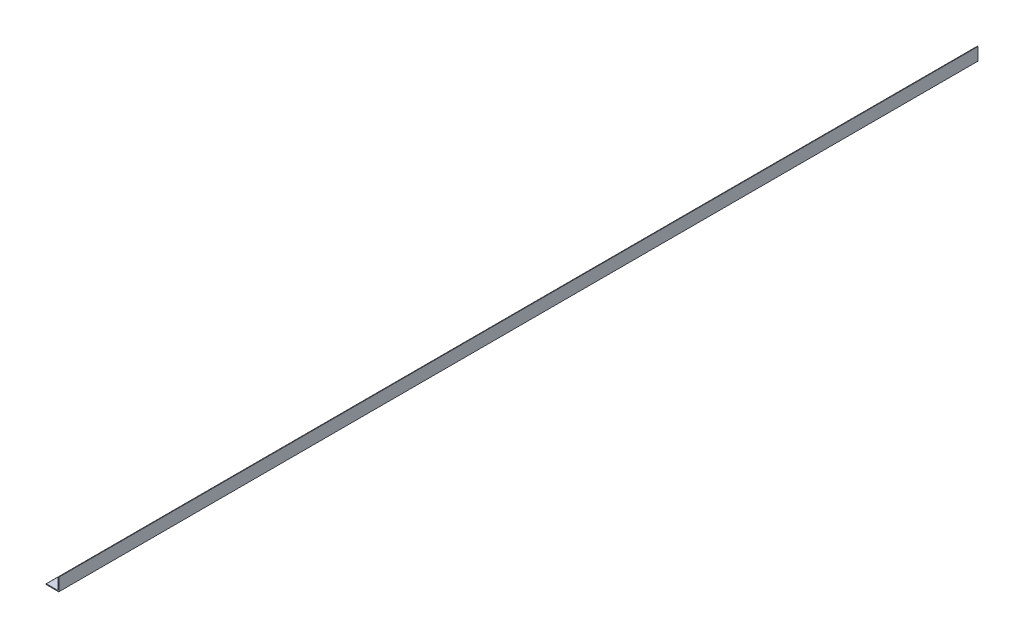
ISO-10303-21;
HEADER;
FILE_DESCRIPTION(('STEP AP214'),'2;1');
FILE_NAME('part.step','',(''),(''),'','','');
FILE_SCHEMA(('AUTOMOTIVE_DESIGN { 1 0 10303 214 1 1 1 1 }'));
ENDSEC;
DATA;
#1=APPLICATION_CONTEXT('core data for automotive mechanical design processes');
#2=APPLICATION_PROTOCOL_DEFINITION('international standard','automotive_design',2000,#1);
#3=PRODUCT_CONTEXT('',#1,'mechanical');
#4=PRODUCT('Part','Part','',(#3));
#5=PRODUCT_RELATED_PRODUCT_CATEGORY('part','',(#4));
#6=PRODUCT_DEFINITION_FORMATION('','',#4);
#7=PRODUCT_DEFINITION_CONTEXT('part definition',#1,'design');
#8=PRODUCT_DEFINITION('design','',#6,#7);
#9=PRODUCT_DEFINITION_SHAPE('','',#8);
#10=(LENGTH_UNIT() NAMED_UNIT(*) SI_UNIT(.MILLI.,.METRE.));
#11=(NAMED_UNIT(*) PLANE_ANGLE_UNIT() SI_UNIT($,.RADIAN.));
#12=(NAMED_UNIT(*) SI_UNIT($,.STERADIAN.) SOLID_ANGLE_UNIT());
#13=UNCERTAINTY_MEASURE_WITH_UNIT(LENGTH_MEASURE(1.E-05),#10,'distance_accuracy_value','');
#14=(GEOMETRIC_REPRESENTATION_CONTEXT(3) GLOBAL_UNCERTAINTY_ASSIGNED_CONTEXT((#13)) GLOBAL_UNIT_ASSIGNED_CONTEXT((#10,
#11,#12)) REPRESENTATION_CONTEXT('',''));
#15=CARTESIAN_POINT('',(0.,0.,0.));
#16=DIRECTION('',(0.,0.,1.));
#17=DIRECTION('',(1.,0.,0.));
#18=AXIS2_PLACEMENT_3D('',#15,#16,#17);
#19=CARTESIAN_POINT('',(-12.7,-11.90625,914.4));
#20=DIRECTION('',(1.,0.,0.));
#21=DIRECTION('',(0.,0.,-1.));
#22=AXIS2_PLACEMENT_3D('',#19,#20,#21);
#23=PLANE('',#22);
#24=DIRECTION('',(0.,-1.,0.));
#25=VECTOR('',#24,1.);
#26=CARTESIAN_POINT('',(-12.7,-11.90625,-914.4));
#27=LINE('',#26,#25);
#28=CARTESIAN_POINT('',(-12.7,-11.90625,-914.4));
#29=VERTEX_POINT('',#28);
#30=CARTESIAN_POINT('',(-12.7,-12.7,-914.4));
#31=VERTEX_POINT('',#30);
#32=EDGE_CURVE('E360',#29,#31,#27,.T.);
#33=ORIENTED_EDGE('',*,*,#32,.T.);
#34=DIRECTION('',(0.,0.,-1.));
#35=VECTOR('',#34,1.);
#36=CARTESIAN_POINT('',(-12.7,-12.7,914.4));
#37=LINE('',#36,#35);
#38=CARTESIAN_POINT('',(-12.7,-12.7,914.4));
#39=VERTEX_POINT('',#38);
#40=EDGE_CURVE('E11',#39,#31,#37,.T.);
#41=ORIENTED_EDGE('',*,*,#40,.F.);
#42=DIRECTION('',(0.,-1.,0.));
#43=VECTOR('',#42,1.);
#44=CARTESIAN_POINT('',(-12.7,-11.90625,914.4));
#45=LINE('',#44,#43);
#46=CARTESIAN_POINT('',(-12.7,-11.90625,914.4));
#47=VERTEX_POINT('',#46);
#48=EDGE_CURVE('E361',#47,#39,#45,.T.);
#49=ORIENTED_EDGE('',*,*,#48,.F.);
#50=DIRECTION('',(0.,0.,-1.));
#51=VECTOR('',#50,1.);
#52=CARTESIAN_POINT('',(-12.7,-11.90625,914.4));
#53=LINE('',#52,#51);
#54=EDGE_CURVE('E381',#47,#29,#53,.T.);
#55=ORIENTED_EDGE('',*,*,#54,.T.);
#56=EDGE_LOOP('',(#33,#41,#49,#55));
#57=FACE_BOUND('',#56,.T.);
#58=ADVANCED_FACE('F36',(#57),#23,.F.);
#59=CARTESIAN_POINT('',(-12.7,-12.7,914.4));
#60=DIRECTION('',(0.,1.,0.));
#61=DIRECTION('',(-1.,0.,0.));
#62=AXIS2_PLACEMENT_3D('',#59,#60,#61);
#63=PLANE('',#62);
#64=DIRECTION('',(0.,0.,1.));
#65=VECTOR('',#64,1.);
#66=CARTESIAN_POINT('',(-4.6355,-12.7,-701.675));
#67=LINE('',#66,#65);
#68=CARTESIAN_POINT('',(-4.6355,-12.7,-720.725));
#69=VERTEX_POINT('',#68);
#70=CARTESIAN_POINT('',(-4.6355,-12.7,-701.675));
#71=VERTEX_POINT('',#70);
#72=EDGE_CURVE('E214',#69,#71,#67,.T.);
#73=ORIENTED_EDGE('',*,*,#72,.T.);
#74=CARTESIAN_POINT('',(-1.5875,-12.7,-701.675));
#75=DIRECTION('',(0.,1.,0.));
#76=DIRECTION('',(0.,0.,1.));
#77=AXIS2_PLACEMENT_3D('',#74,#75,#76);
#78=CIRCLE('',#77,3.048);
#79=CARTESIAN_POINT('',(1.46050000000001,-12.7,-701.675));
#80=VERTEX_POINT('',#79);
#81=EDGE_CURVE('E206',#71,#80,#78,.T.);
#82=ORIENTED_EDGE('',*,*,#81,.T.);
#83=DIRECTION('',(0.,0.,-1.));
#84=VECTOR('',#83,1.);
#85=CARTESIAN_POINT('',(1.46050000000001,-12.7,-701.675));
#86=LINE('',#85,#84);
#87=CARTESIAN_POINT('',(1.4605,-12.7,-720.725));
#88=VERTEX_POINT('',#87);
#89=EDGE_CURVE('E217',#80,#88,#86,.T.);
#90=ORIENTED_EDGE('',*,*,#89,.T.);
#91=CARTESIAN_POINT('',(-1.5875,-12.7,-720.725));
#92=DIRECTION('',(0.,1.,0.));
#93=DIRECTION('',(0.,0.,1.));
#94=AXIS2_PLACEMENT_3D('',#91,#92,#93);
#95=CIRCLE('',#94,3.048);
#96=EDGE_CURVE('E50',#88,#69,#95,.T.);
#97=ORIENTED_EDGE('',*,*,#96,.T.);
#98=EDGE_LOOP('',(#73,#82,#90,#97));
#99=FACE_BOUND('',#98,.T.);
#100=DIRECTION('',(0.,0.,-1.));
#101=VECTOR('',#100,1.);
#102=CARTESIAN_POINT('',(1.4605,-12.7,-304.8));
#103=LINE('',#102,#101);
#104=CARTESIAN_POINT('',(1.4605,-12.7,-285.75));
#105=VERTEX_POINT('',#104);
#106=CARTESIAN_POINT('',(1.4605,-12.7,-304.8));
#107=VERTEX_POINT('',#106);
#108=EDGE_CURVE('E252',#105,#107,#103,.T.);
#109=ORIENTED_EDGE('',*,*,#108,.T.);
#110=CARTESIAN_POINT('',(-1.5875,-12.7,-304.8));
#111=DIRECTION('',(0.,1.,0.));
#112=DIRECTION('',(0.,0.,1.));
#113=AXIS2_PLACEMENT_3D('',#110,#111,#112);
#114=CIRCLE('',#113,3.048);
#115=CARTESIAN_POINT('',(-4.6355,-12.7,-304.8));
#116=VERTEX_POINT('',#115);
#117=EDGE_CURVE('E244',#107,#116,#114,.T.);
#118=ORIENTED_EDGE('',*,*,#117,.T.);
#119=DIRECTION('',(0.,0.,1.));
#120=VECTOR('',#119,1.);
#121=CARTESIAN_POINT('',(-4.6355,-12.7,-304.8));
#122=LINE('',#121,#120);
#123=CARTESIAN_POINT('',(-4.6355,-12.7,-285.75));
#124=VERTEX_POINT('',#123);
#125=EDGE_CURVE('E247',#116,#124,#122,.T.);
#126=ORIENTED_EDGE('',*,*,#125,.T.);
#127=CARTESIAN_POINT('',(-1.5875,-12.7,-285.75));
#128=DIRECTION('',(0.,1.,0.));
#129=DIRECTION('',(0.,0.,1.));
#130=AXIS2_PLACEMENT_3D('',#127,#128,#129);
#131=CIRCLE('',#130,3.048);
#132=EDGE_CURVE('E58',#124,#105,#131,.T.);
#133=ORIENTED_EDGE('',*,*,#132,.T.);
#134=EDGE_LOOP('',(#109,#118,#126,#133));
#135=FACE_BOUND('',#134,.T.);
#136=DIRECTION('',(0.,0.,1.));
#137=VECTOR('',#136,1.);
#138=CARTESIAN_POINT('',(-4.6355,-12.7,336.55));
#139=LINE('',#138,#137);
#140=CARTESIAN_POINT('',(-4.6355,-12.7,317.5));
#141=VERTEX_POINT('',#140);
#142=CARTESIAN_POINT('',(-4.6355,-12.7,336.55));
#143=VERTEX_POINT('',#142);
#144=EDGE_CURVE('E284',#141,#143,#139,.T.);
#145=ORIENTED_EDGE('',*,*,#144,.T.);
#146=CARTESIAN_POINT('',(-1.5875,-12.7,336.55));
#147=DIRECTION('',(0.,1.,0.));
#148=DIRECTION('',(0.,0.,-1.));
#149=AXIS2_PLACEMENT_3D('',#146,#147,#148);
#150=CIRCLE('',#149,3.048);
#151=CARTESIAN_POINT('',(1.4605,-12.7,336.55));
#152=VERTEX_POINT('',#151);
#153=EDGE_CURVE('E274',#143,#152,#150,.T.);
#154=ORIENTED_EDGE('',*,*,#153,.T.);
#155=DIRECTION('',(0.,0.,-1.));
#156=VECTOR('',#155,1.);
#157=CARTESIAN_POINT('',(1.4605,-12.7,336.55));
#158=LINE('',#157,#156);
#159=CARTESIAN_POINT('',(1.4605,-12.7,317.5));
#160=VERTEX_POINT('',#159);
#161=EDGE_CURVE('E277',#152,#160,#158,.T.);
#162=ORIENTED_EDGE('',*,*,#161,.T.);
#163=CARTESIAN_POINT('',(-1.5875,-12.7,317.5));
#164=DIRECTION('',(0.,1.,0.));
#165=DIRECTION('',(0.,0.,-1.));
#166=AXIS2_PLACEMENT_3D('',#163,#164,#165);
#167=CIRCLE('',#166,3.048);
#168=EDGE_CURVE('E281',#160,#141,#167,.T.);
#169=ORIENTED_EDGE('',*,*,#168,.T.);
#170=EDGE_LOOP('',(#145,#154,#162,#169));
#171=FACE_BOUND('',#170,.T.);
#172=DIRECTION('',(0.,0.,-1.));
#173=VECTOR('',#172,1.);
#174=CARTESIAN_POINT('',(1.4605,-12.7,717.55));
#175=LINE('',#174,#173);
#176=CARTESIAN_POINT('',(1.4605,-12.7,736.6));
#177=VERTEX_POINT('',#176);
#178=CARTESIAN_POINT('',(1.4605,-12.7,717.55));
#179=VERTEX_POINT('',#178);
#180=EDGE_CURVE('E316',#177,#179,#175,.T.);
#181=ORIENTED_EDGE('',*,*,#180,.T.);
#182=CARTESIAN_POINT('',(-1.5875,-12.7,717.55));
#183=DIRECTION('',(0.,1.,0.));
#184=DIRECTION('',(0.,0.,-1.));
#185=AXIS2_PLACEMENT_3D('',#182,#183,#184);
#186=CIRCLE('',#185,3.048);
#187=CARTESIAN_POINT('',(-4.6355,-12.7,717.55));
#188=VERTEX_POINT('',#187);
#189=EDGE_CURVE('E306',#179,#188,#186,.T.);
#190=ORIENTED_EDGE('',*,*,#189,.T.);
#191=DIRECTION('',(0.,0.,1.));
#192=VECTOR('',#191,1.);
#193=CARTESIAN_POINT('',(-4.6355,-12.7,717.55));
#194=LINE('',#193,#192);
#195=CARTESIAN_POINT('',(-4.6355,-12.7,736.6));
#196=VERTEX_POINT('',#195);
#197=EDGE_CURVE('E309',#188,#196,#194,.T.);
#198=ORIENTED_EDGE('',*,*,#197,.T.);
#199=CARTESIAN_POINT('',(-1.5875,-12.7,736.6));
#200=DIRECTION('',(0.,1.,0.));
#201=DIRECTION('',(0.,0.,-1.));
#202=AXIS2_PLACEMENT_3D('',#199,#200,#201);
#203=CIRCLE('',#202,3.048);
#204=EDGE_CURVE('E313',#196,#177,#203,.T.);
#205=ORIENTED_EDGE('',*,*,#204,.T.);
#206=EDGE_LOOP('',(#181,#190,#198,#205));
#207=FACE_BOUND('',#206,.T.);
#208=CARTESIAN_POINT('',(-1.5875,-12.7,705.104));
#209=DIRECTION('',(0.,1.,0.));
#210=DIRECTION('',(0.,0.,1.));
#211=AXIS2_PLACEMENT_3D('',#208,#209,#210);
#212=CIRCLE('',#211,2.5527);
#213=CARTESIAN_POINT('',(-1.5875,-12.7,707.6567));
#214=VERTEX_POINT('',#213);
#215=EDGE_CURVE('E339',#214,#214,#212,.T.);
#216=ORIENTED_EDGE('',*,*,#215,.T.);
#217=EDGE_LOOP('',(#216));
#218=FACE_BOUND('',#217,.T.);
#219=CARTESIAN_POINT('',(-1.5875,-12.7,249.428));
#220=DIRECTION('',(0.,1.,0.));
#221=DIRECTION('',(0.,0.,1.));
#222=AXIS2_PLACEMENT_3D('',#219,#220,#221);
#223=CIRCLE('',#222,2.5527);
#224=CARTESIAN_POINT('',(-1.5875,-12.7,251.9807));
#225=VERTEX_POINT('',#224);
#226=EDGE_CURVE('E345',#225,#225,#223,.T.);
#227=ORIENTED_EDGE('',*,*,#226,.T.);
#228=EDGE_LOOP('',(#227));
#229=FACE_BOUND('',#228,.T.);
#230=CARTESIAN_POINT('',(-1.5875,-12.7,-661.924));
#231=DIRECTION('',(0.,1.,0.));
#232=DIRECTION('',(0.,0.,1.));
#233=AXIS2_PLACEMENT_3D('',#230,#231,#232);
#234=CIRCLE('',#233,2.5527);
#235=CARTESIAN_POINT('',(-1.5875,-12.7,-659.3713));
#236=VERTEX_POINT('',#235);
#237=EDGE_CURVE('E351',#236,#236,#234,.T.);
#238=ORIENTED_EDGE('',*,*,#237,.T.);
#239=EDGE_LOOP('',(#238));
#240=FACE_BOUND('',#239,.T.);
#241=CARTESIAN_POINT('',(-1.5875,-12.7,-206.248));
#242=DIRECTION('',(0.,1.,0.));
#243=DIRECTION('',(0.,0.,1.));
#244=AXIS2_PLACEMENT_3D('',#241,#242,#243);
#245=CIRCLE('',#244,2.5527);
#246=CARTESIAN_POINT('',(-1.5875,-12.7,-203.6953));
#247=VERTEX_POINT('',#246);
#248=EDGE_CURVE('E357',#247,#247,#245,.T.);
#249=ORIENTED_EDGE('',*,*,#248,.T.);
#250=EDGE_LOOP('',(#249));
#251=FACE_BOUND('',#250,.T.);
#252=DIRECTION('',(1.,0.,0.));
#253=VECTOR('',#252,1.);
#254=CARTESIAN_POINT('',(-12.7,-12.7,-914.4));
#255=LINE('',#254,#253);
#256=CARTESIAN_POINT('',(12.7,-12.7,-914.4));
#257=VERTEX_POINT('',#256);
#258=EDGE_CURVE('E384',#31,#257,#255,.T.);
#259=ORIENTED_EDGE('',*,*,#258,.T.);
#260=DIRECTION('',(0.,0.,-1.));
#261=VECTOR('',#260,1.);
#262=CARTESIAN_POINT('',(12.7,-12.7,914.4));
#263=LINE('',#262,#261);
#264=CARTESIAN_POINT('',(12.7,-12.7,914.4));
#265=VERTEX_POINT('',#264);
#266=EDGE_CURVE('E43',#265,#257,#263,.T.);
#267=ORIENTED_EDGE('',*,*,#266,.F.);
#268=DIRECTION('',(1.,0.,0.));
#269=VECTOR('',#268,1.);
#270=CARTESIAN_POINT('',(-12.7,-12.7,914.4));
#271=LINE('',#270,#269);
#272=EDGE_CURVE('E364',#39,#265,#271,.T.);
#273=ORIENTED_EDGE('',*,*,#272,.F.);
#274=ORIENTED_EDGE('',*,*,#40,.T.);
#275=EDGE_LOOP('',(#259,#267,#273,#274));
#276=FACE_BOUND('',#275,.T.);
#277=ADVANCED_FACE('F221',(#99,#135,#171,#207,#218,#229,#240,#251,#276),#63,.F.);
#278=CARTESIAN_POINT('',(12.7,-12.7,914.4));
#279=DIRECTION('',(-1.,0.,0.));
#280=DIRECTION('',(0.,-1.,0.));
#281=AXIS2_PLACEMENT_3D('',#278,#279,#280);
#282=PLANE('',#281);
#283=DIRECTION('',(0.,1.,0.));
#284=VECTOR('',#283,1.);
#285=CARTESIAN_POINT('',(12.7,-12.7,-914.4));
#286=LINE('',#285,#284);
#287=CARTESIAN_POINT('',(12.7,12.7,-914.4));
#288=VERTEX_POINT('',#287);
#289=EDGE_CURVE('E386',#257,#288,#286,.T.);
#290=ORIENTED_EDGE('',*,*,#289,.T.);
#291=DIRECTION('',(0.,0.,-1.));
#292=VECTOR('',#291,1.);
#293=CARTESIAN_POINT('',(12.7,12.7,914.4));
#294=LINE('',#293,#292);
#295=CARTESIAN_POINT('',(12.7,12.7,914.4));
#296=VERTEX_POINT('',#295);
#297=EDGE_CURVE('E416',#296,#288,#294,.T.);
#298=ORIENTED_EDGE('',*,*,#297,.F.);
#299=DIRECTION('',(0.,1.,0.));
#300=VECTOR('',#299,1.);
#301=CARTESIAN_POINT('',(12.7,-12.7,914.4));
#302=LINE('',#301,#300);
#303=EDGE_CURVE('E367',#265,#296,#302,.T.);
#304=ORIENTED_EDGE('',*,*,#303,.F.);
#305=ORIENTED_EDGE('',*,*,#266,.T.);
#306=EDGE_LOOP('',(#290,#298,#304,#305));
#307=FACE_BOUND('',#306,.T.);
#308=ADVANCED_FACE('F423',(#307),#282,.F.);
#309=CARTESIAN_POINT('',(11.90625,12.7,914.4));
#310=DIRECTION('',(0.,-1.,0.));
#311=DIRECTION('',(0.,0.,-1.));
#312=AXIS2_PLACEMENT_3D('',#309,#310,#311);
#313=PLANE('',#312);
#314=DIRECTION('',(-1.,0.,0.));
#315=VECTOR('',#314,1.);
#316=CARTESIAN_POINT('',(11.90625,12.7,-914.4));
#317=LINE('',#316,#315);
#318=CARTESIAN_POINT('',(11.90625,12.7,-914.4));
#319=VERTEX_POINT('',#318);
#320=EDGE_CURVE('E388',#288,#319,#317,.T.);
#321=ORIENTED_EDGE('',*,*,#320,.T.);
#322=DIRECTION('',(0.,0.,-1.));
#323=VECTOR('',#322,1.);
#324=CARTESIAN_POINT('',(11.90625,12.7,914.4));
#325=LINE('',#324,#323);
#326=CARTESIAN_POINT('',(11.90625,12.7,914.4));
#327=VERTEX_POINT('',#326);
#328=EDGE_CURVE('E413',#327,#319,#325,.T.);
#329=ORIENTED_EDGE('',*,*,#328,.F.);
#330=DIRECTION('',(-1.,0.,0.));
#331=VECTOR('',#330,1.);
#332=CARTESIAN_POINT('',(11.90625,12.7,914.4));
#333=LINE('',#332,#331);
#334=EDGE_CURVE('E369',#296,#327,#333,.T.);
#335=ORIENTED_EDGE('',*,*,#334,.F.);
#336=ORIENTED_EDGE('',*,*,#297,.T.);
#337=EDGE_LOOP('',(#321,#329,#335,#336));
#338=FACE_BOUND('',#337,.T.);
#339=ADVANCED_FACE('F434',(#338),#313,.F.);
#340=CARTESIAN_POINT('',(11.90625,11.90625,914.4));
#341=DIRECTION('',(0.,0.,-1.));
#342=DIRECTION('',(-1.,0.,0.));
#343=AXIS2_PLACEMENT_3D('',#340,#341,#342);
#344=CYLINDRICAL_SURFACE('',#343,0.793749999999998);
#345=CARTESIAN_POINT('',(11.90625,11.90625,-914.4));
#346=DIRECTION('',(0.,0.,1.));
#347=DIRECTION('',(-1.,0.,0.));
#348=AXIS2_PLACEMENT_3D('',#345,#346,#347);
#349=CIRCLE('',#348,0.793749999999998);
#350=CARTESIAN_POINT('',(11.1125,11.90625,-914.4));
#351=VERTEX_POINT('',#350);
#352=EDGE_CURVE('E390',#319,#351,#349,.T.);
#353=ORIENTED_EDGE('',*,*,#352,.T.);
#354=DIRECTION('',(0.,0.,-1.));
#355=VECTOR('',#354,1.);
#356=CARTESIAN_POINT('',(11.1125,11.90625,914.4));
#357=LINE('',#356,#355);
#358=CARTESIAN_POINT('',(11.1125,11.90625,914.4));
#359=VERTEX_POINT('',#358);
#360=EDGE_CURVE('E410',#359,#351,#357,.T.);
#361=ORIENTED_EDGE('',*,*,#360,.F.);
#362=CARTESIAN_POINT('',(11.90625,11.90625,914.4));
#363=DIRECTION('',(0.,0.,1.));
#364=DIRECTION('',(-1.,0.,0.));
#365=AXIS2_PLACEMENT_3D('',#362,#363,#364);
#366=CIRCLE('',#365,0.793749999999998);
#367=EDGE_CURVE('E371',#327,#359,#366,.T.);
#368=ORIENTED_EDGE('',*,*,#367,.F.);
#369=ORIENTED_EDGE('',*,*,#328,.T.);
#370=EDGE_LOOP('',(#353,#361,#368,#369));
#371=FACE_BOUND('',#370,.T.);
#372=ADVANCED_FACE('F438',(#371),#344,.T.);
#373=CARTESIAN_POINT('',(11.1125,11.90625,914.4));
#374=DIRECTION('',(1.,0.,0.));
#375=DIRECTION('',(0.,1.,0.));
#376=AXIS2_PLACEMENT_3D('',#373,#374,#375);
#377=PLANE('',#376);
#378=DIRECTION('',(0.,-1.,0.));
#379=VECTOR('',#378,1.);
#380=CARTESIAN_POINT('',(11.1125,11.90625,-914.4));
#381=LINE('',#380,#379);
#382=CARTESIAN_POINT('',(11.1125,-9.5377,-914.4));
#383=VERTEX_POINT('',#382);
#384=EDGE_CURVE('E392',#351,#383,#381,.T.);
#385=ORIENTED_EDGE('',*,*,#384,.T.);
#386=DIRECTION('',(0.,0.,-1.));
#387=VECTOR('',#386,1.);
#388=CARTESIAN_POINT('',(11.1125,-9.5377,914.4));
#389=LINE('',#388,#387);
#390=CARTESIAN_POINT('',(11.1125,-9.5377,914.4));
#391=VERTEX_POINT('',#390);
#392=EDGE_CURVE('E407',#391,#383,#389,.T.);
#393=ORIENTED_EDGE('',*,*,#392,.F.);
#394=DIRECTION('',(0.,-1.,0.));
#395=VECTOR('',#394,1.);
#396=CARTESIAN_POINT('',(11.1125,11.90625,914.4));
#397=LINE('',#396,#395);
#398=EDGE_CURVE('E373',#359,#391,#397,.T.);
#399=ORIENTED_EDGE('',*,*,#398,.F.);
#400=ORIENTED_EDGE('',*,*,#360,.T.);
#401=EDGE_LOOP('',(#385,#393,#399,#400));
#402=FACE_BOUND('',#401,.T.);
#403=ADVANCED_FACE('F463',(#402),#377,.F.);
#404=CARTESIAN_POINT('',(9.5377,-9.5377,914.4));
#405=DIRECTION('',(0.,0.,-1.));
#406=DIRECTION('',(-1.,0.,0.));
#407=AXIS2_PLACEMENT_3D('',#404,#405,#406);
#408=CYLINDRICAL_SURFACE('',#407,1.5748);
#409=CARTESIAN_POINT('',(9.5377,-9.5377,-914.4));
#410=DIRECTION('',(0.,0.,-1.));
#411=DIRECTION('',(-1.,0.,0.));
#412=AXIS2_PLACEMENT_3D('',#409,#410,#411);
#413=CIRCLE('',#412,1.5748);
#414=CARTESIAN_POINT('',(9.5377,-11.1125,-914.4));
#415=VERTEX_POINT('',#414);
#416=EDGE_CURVE('E394',#383,#415,#413,.T.);
#417=ORIENTED_EDGE('',*,*,#416,.T.);
#418=DIRECTION('',(0.,0.,-1.));
#419=VECTOR('',#418,1.);
#420=CARTESIAN_POINT('',(9.5377,-11.1125,914.4));
#421=LINE('',#420,#419);
#422=CARTESIAN_POINT('',(9.5377,-11.1125,914.4));
#423=VERTEX_POINT('',#422);
#424=EDGE_CURVE('E404',#423,#415,#421,.T.);
#425=ORIENTED_EDGE('',*,*,#424,.F.);
#426=CARTESIAN_POINT('',(9.5377,-9.5377,914.4));
#427=DIRECTION('',(0.,0.,-1.));
#428=DIRECTION('',(-1.,0.,0.));
#429=AXIS2_PLACEMENT_3D('',#426,#427,#428);
#430=CIRCLE('',#429,1.5748);
#431=EDGE_CURVE('E375',#391,#423,#430,.T.);
#432=ORIENTED_EDGE('',*,*,#431,.F.);
#433=ORIENTED_EDGE('',*,*,#392,.T.);
#434=EDGE_LOOP('',(#417,#425,#432,#433));
#435=FACE_BOUND('',#434,.T.);
#436=ADVANCED_FACE('F461',(#435),#408,.F.);
#437=CARTESIAN_POINT('',(9.5377,-11.1125,914.4));
#438=DIRECTION('',(0.,-1.,0.));
#439=DIRECTION('',(0.,0.,-1.));
#440=AXIS2_PLACEMENT_3D('',#437,#438,#439);
#441=PLANE('',#440);
#442=DIRECTION('',(0.,0.,-1.));
#443=VECTOR('',#442,1.);
#444=CARTESIAN_POINT('',(1.46050000000001,-11.1125,-701.675));
#445=LINE('',#444,#443);
#446=CARTESIAN_POINT('',(1.46050000000001,-11.1125,-701.675));
#447=VERTEX_POINT('',#446);
#448=CARTESIAN_POINT('',(1.4605,-11.1125,-720.725));
#449=VERTEX_POINT('',#448);
#450=EDGE_CURVE('E233',#447,#449,#445,.T.);
#451=ORIENTED_EDGE('',*,*,#450,.F.);
#452=CARTESIAN_POINT('',(-1.5875,-11.1125,-701.675));
#453=DIRECTION('',(0.,1.,0.));
#454=DIRECTION('',(0.,0.,1.));
#455=AXIS2_PLACEMENT_3D('',#452,#453,#454);
#456=CIRCLE('',#455,3.048);
#457=CARTESIAN_POINT('',(-4.6355,-11.1125,-701.675));
#458=VERTEX_POINT('',#457);
#459=EDGE_CURVE('E209',#458,#447,#456,.T.);
#460=ORIENTED_EDGE('',*,*,#459,.F.);
#461=DIRECTION('',(0.,0.,1.));
#462=VECTOR('',#461,1.);
#463=CARTESIAN_POINT('',(-4.6355,-11.1125,-701.675));
#464=LINE('',#463,#462);
#465=CARTESIAN_POINT('',(-4.6355,-11.1125,-720.725));
#466=VERTEX_POINT('',#465);
#467=EDGE_CURVE('E224',#466,#458,#464,.T.);
#468=ORIENTED_EDGE('',*,*,#467,.F.);
#469=CARTESIAN_POINT('',(-1.5875,-11.1125,-720.725));
#470=DIRECTION('',(0.,1.,0.));
#471=DIRECTION('',(0.,0.,1.));
#472=AXIS2_PLACEMENT_3D('',#469,#470,#471);
#473=CIRCLE('',#472,3.048);
#474=EDGE_CURVE('E227',#449,#466,#473,.T.);
#475=ORIENTED_EDGE('',*,*,#474,.F.);
#476=EDGE_LOOP('',(#451,#460,#468,#475));
#477=FACE_BOUND('',#476,.T.);
#478=DIRECTION('',(0.,0.,1.));
#479=VECTOR('',#478,1.);
#480=CARTESIAN_POINT('',(-4.6355,-11.1125,-304.8));
#481=LINE('',#480,#479);
#482=CARTESIAN_POINT('',(-4.6355,-11.1125,-304.8));
#483=VERTEX_POINT('',#482);
#484=CARTESIAN_POINT('',(-4.6355,-11.1125,-285.75));
#485=VERTEX_POINT('',#484);
#486=EDGE_CURVE('E258',#483,#485,#481,.T.);
#487=ORIENTED_EDGE('',*,*,#486,.F.);
#488=CARTESIAN_POINT('',(-1.5875,-11.1125,-304.8));
#489=DIRECTION('',(0.,1.,0.));
#490=DIRECTION('',(0.,0.,1.));
#491=AXIS2_PLACEMENT_3D('',#488,#489,#490);
#492=CIRCLE('',#491,3.048);
#493=CARTESIAN_POINT('',(1.4605,-11.1125,-304.8));
#494=VERTEX_POINT('',#493);
#495=EDGE_CURVE('E256',#494,#483,#492,.T.);
#496=ORIENTED_EDGE('',*,*,#495,.F.);
#497=DIRECTION('',(0.,0.,-1.));
#498=VECTOR('',#497,1.);
#499=CARTESIAN_POINT('',(1.4605,-11.1125,-304.8));
#500=LINE('',#499,#498);
#501=CARTESIAN_POINT('',(1.4605,-11.1125,-285.75));
#502=VERTEX_POINT('',#501);
#503=EDGE_CURVE('E248',#502,#494,#500,.T.);
#504=ORIENTED_EDGE('',*,*,#503,.F.);
#505=CARTESIAN_POINT('',(-1.5875,-11.1125,-285.75));
#506=DIRECTION('',(0.,1.,0.));
#507=DIRECTION('',(0.,0.,1.));
#508=AXIS2_PLACEMENT_3D('',#505,#506,#507);
#509=CIRCLE('',#508,3.048);
#510=EDGE_CURVE('E262',#485,#502,#509,.T.);
#511=ORIENTED_EDGE('',*,*,#510,.F.);
#512=EDGE_LOOP('',(#487,#496,#504,#511));
#513=FACE_BOUND('',#512,.T.);
#514=DIRECTION('',(0.,0.,-1.));
#515=VECTOR('',#514,1.);
#516=CARTESIAN_POINT('',(1.4605,-11.1125,336.55));
#517=LINE('',#516,#515);
#518=CARTESIAN_POINT('',(1.4605,-11.1125,336.55));
#519=VERTEX_POINT('',#518);
#520=CARTESIAN_POINT('',(1.4605,-11.1125,317.5));
#521=VERTEX_POINT('',#520);
#522=EDGE_CURVE('E290',#519,#521,#517,.T.);
#523=ORIENTED_EDGE('',*,*,#522,.F.);
#524=CARTESIAN_POINT('',(-1.5875,-11.1125,336.55));
#525=DIRECTION('',(0.,1.,0.));
#526=DIRECTION('',(0.,0.,-1.));
#527=AXIS2_PLACEMENT_3D('',#524,#525,#526);
#528=CIRCLE('',#527,3.048);
#529=CARTESIAN_POINT('',(-4.6355,-11.1125,336.55));
#530=VERTEX_POINT('',#529);
#531=EDGE_CURVE('E288',#530,#519,#528,.T.);
#532=ORIENTED_EDGE('',*,*,#531,.F.);
#533=DIRECTION('',(0.,0.,1.));
#534=VECTOR('',#533,1.);
#535=CARTESIAN_POINT('',(-4.6355,-11.1125,336.55));
#536=LINE('',#535,#534);
#537=CARTESIAN_POINT('',(-4.6355,-11.1125,317.5));
#538=VERTEX_POINT('',#537);
#539=EDGE_CURVE('E278',#538,#530,#536,.T.);
#540=ORIENTED_EDGE('',*,*,#539,.F.);
#541=CARTESIAN_POINT('',(-1.5875,-11.1125,317.5));
#542=DIRECTION('',(0.,1.,0.));
#543=DIRECTION('',(0.,0.,-1.));
#544=AXIS2_PLACEMENT_3D('',#541,#542,#543);
#545=CIRCLE('',#544,3.048);
#546=EDGE_CURVE('E294',#521,#538,#545,.T.);
#547=ORIENTED_EDGE('',*,*,#546,.F.);
#548=EDGE_LOOP('',(#523,#532,#540,#547));
#549=FACE_BOUND('',#548,.T.);
#550=DIRECTION('',(0.,0.,1.));
#551=VECTOR('',#550,1.);
#552=CARTESIAN_POINT('',(-4.6355,-11.1125,717.55));
#553=LINE('',#552,#551);
#554=CARTESIAN_POINT('',(-4.6355,-11.1125,717.55));
#555=VERTEX_POINT('',#554);
#556=CARTESIAN_POINT('',(-4.6355,-11.1125,736.6));
#557=VERTEX_POINT('',#556);
#558=EDGE_CURVE('E322',#555,#557,#553,.T.);
#559=ORIENTED_EDGE('',*,*,#558,.F.);
#560=CARTESIAN_POINT('',(-1.5875,-11.1125,717.55));
#561=DIRECTION('',(0.,1.,0.));
#562=DIRECTION('',(0.,0.,-1.));
#563=AXIS2_PLACEMENT_3D('',#560,#561,#562);
#564=CIRCLE('',#563,3.048);
#565=CARTESIAN_POINT('',(1.4605,-11.1125,717.55));
#566=VERTEX_POINT('',#565);
#567=EDGE_CURVE('E320',#566,#555,#564,.T.);
#568=ORIENTED_EDGE('',*,*,#567,.F.);
#569=DIRECTION('',(0.,0.,-1.));
#570=VECTOR('',#569,1.);
#571=CARTESIAN_POINT('',(1.4605,-11.1125,717.55));
#572=LINE('',#571,#570);
#573=CARTESIAN_POINT('',(1.4605,-11.1125,736.6));
#574=VERTEX_POINT('',#573);
#575=EDGE_CURVE('E310',#574,#566,#572,.T.);
#576=ORIENTED_EDGE('',*,*,#575,.F.);
#577=CARTESIAN_POINT('',(-1.5875,-11.1125,736.6));
#578=DIRECTION('',(0.,1.,0.));
#579=DIRECTION('',(0.,0.,-1.));
#580=AXIS2_PLACEMENT_3D('',#577,#578,#579);
#581=CIRCLE('',#580,3.048);
#582=EDGE_CURVE('E325',#557,#574,#581,.T.);
#583=ORIENTED_EDGE('',*,*,#582,.F.);
#584=EDGE_LOOP('',(#559,#568,#576,#583));
#585=FACE_BOUND('',#584,.T.);
#586=CARTESIAN_POINT('',(-1.5875,-11.1125,705.104));
#587=DIRECTION('',(0.,1.,0.));
#588=DIRECTION('',(0.,0.,1.));
#589=AXIS2_PLACEMENT_3D('',#586,#587,#588);
#590=CIRCLE('',#589,2.55269999999999);
#591=CARTESIAN_POINT('',(-1.5875,-11.1125,707.6567));
#592=VERTEX_POINT('',#591);
#593=EDGE_CURVE('E240',#592,#592,#590,.T.);
#594=ORIENTED_EDGE('',*,*,#593,.F.);
#595=EDGE_LOOP('',(#594));
#596=FACE_BOUND('',#595,.T.);
#597=CARTESIAN_POINT('',(-1.5875,-11.1125,249.428));
#598=DIRECTION('',(0.,1.,0.));
#599=DIRECTION('',(0.,0.,1.));
#600=AXIS2_PLACEMENT_3D('',#597,#598,#599);
#601=CIRCLE('',#600,2.55269999999999);
#602=CARTESIAN_POINT('',(-1.5875,-11.1125,251.9807));
#603=VERTEX_POINT('',#602);
#604=EDGE_CURVE('E342',#603,#603,#601,.T.);
#605=ORIENTED_EDGE('',*,*,#604,.F.);
#606=EDGE_LOOP('',(#605));
#607=FACE_BOUND('',#606,.T.);
#608=CARTESIAN_POINT('',(-1.5875,-11.1125,-661.924));
#609=DIRECTION('',(0.,1.,0.));
#610=DIRECTION('',(0.,0.,1.));
#611=AXIS2_PLACEMENT_3D('',#608,#609,#610);
#612=CIRCLE('',#611,2.55269999999999);
#613=CARTESIAN_POINT('',(-1.5875,-11.1125,-659.3713));
#614=VERTEX_POINT('',#613);
#615=EDGE_CURVE('E348',#614,#614,#612,.T.);
#616=ORIENTED_EDGE('',*,*,#615,.F.);
#617=EDGE_LOOP('',(#616));
#618=FACE_BOUND('',#617,.T.);
#619=CARTESIAN_POINT('',(-1.5875,-11.1125,-206.248));
#620=DIRECTION('',(0.,1.,0.));
#621=DIRECTION('',(0.,0.,1.));
#622=AXIS2_PLACEMENT_3D('',#619,#620,#621);
#623=CIRCLE('',#622,2.55269999999999);
#624=CARTESIAN_POINT('',(-1.5875,-11.1125,-203.6953));
#625=VERTEX_POINT('',#624);
#626=EDGE_CURVE('E354',#625,#625,#623,.T.);
#627=ORIENTED_EDGE('',*,*,#626,.F.);
#628=EDGE_LOOP('',(#627));
#629=FACE_BOUND('',#628,.T.);
#630=DIRECTION('',(-1.,0.,0.));
#631=VECTOR('',#630,1.);
#632=CARTESIAN_POINT('',(9.5377,-11.1125,-914.4));
#633=LINE('',#632,#631);
#634=CARTESIAN_POINT('',(-11.90625,-11.1125,-914.4));
#635=VERTEX_POINT('',#634);
#636=EDGE_CURVE('E396',#415,#635,#633,.T.);
#637=ORIENTED_EDGE('',*,*,#636,.T.);
#638=DIRECTION('',(0.,0.,-1.));
#639=VECTOR('',#638,1.);
#640=CARTESIAN_POINT('',(-11.90625,-11.1125,914.4));
#641=LINE('',#640,#639);
#642=CARTESIAN_POINT('',(-11.90625,-11.1125,914.4));
#643=VERTEX_POINT('',#642);
#644=EDGE_CURVE('E401',#643,#635,#641,.T.);
#645=ORIENTED_EDGE('',*,*,#644,.F.);
#646=DIRECTION('',(-1.,0.,0.));
#647=VECTOR('',#646,1.);
#648=CARTESIAN_POINT('',(9.5377,-11.1125,914.4));
#649=LINE('',#648,#647);
#650=EDGE_CURVE('E377',#423,#643,#649,.T.);
#651=ORIENTED_EDGE('',*,*,#650,.F.);
#652=ORIENTED_EDGE('',*,*,#424,.T.);
#653=EDGE_LOOP('',(#637,#645,#651,#652));
#654=FACE_BOUND('',#653,.T.);
#655=ADVANCED_FACE('F457',(#477,#513,#549,#585,#596,#607,#618,#629,#654),#441,.F.);
#656=CARTESIAN_POINT('',(-11.90625,-11.90625,914.4));
#657=DIRECTION('',(0.,0.,-1.));
#658=DIRECTION('',(-1.,0.,0.));
#659=AXIS2_PLACEMENT_3D('',#656,#657,#658);
#660=CYLINDRICAL_SURFACE('',#659,0.79375);
#661=CARTESIAN_POINT('',(-11.90625,-11.90625,-914.4));
#662=DIRECTION('',(0.,0.,1.));
#663=DIRECTION('',(-1.,0.,0.));
#664=AXIS2_PLACEMENT_3D('',#661,#662,#663);
#665=CIRCLE('',#664,0.79375);
#666=EDGE_CURVE('E365',#635,#29,#665,.T.);
#667=ORIENTED_EDGE('',*,*,#666,.T.);
#668=ORIENTED_EDGE('',*,*,#54,.F.);
#669=CARTESIAN_POINT('',(-11.90625,-11.90625,914.4));
#670=DIRECTION('',(0.,0.,1.));
#671=DIRECTION('',(-1.,0.,0.));
#672=AXIS2_PLACEMENT_3D('',#669,#670,#671);
#673=CIRCLE('',#672,0.79375);
#674=EDGE_CURVE('E379',#643,#47,#673,.T.);
#675=ORIENTED_EDGE('',*,*,#674,.F.);
#676=ORIENTED_EDGE('',*,*,#644,.T.);
#677=EDGE_LOOP('',(#667,#668,#675,#676));
#678=FACE_BOUND('',#677,.T.);
#679=ADVANCED_FACE('F452',(#678),#660,.T.);
#680=CARTESIAN_POINT('',(11.90625,11.90625,914.4));
#681=DIRECTION('',(0.,0.,-1.));
#682=DIRECTION('',(-1.,0.,0.));
#683=AXIS2_PLACEMENT_3D('',#680,#681,#682);
#684=PLANE('',#683);
#685=ORIENTED_EDGE('',*,*,#48,.T.);
#686=ORIENTED_EDGE('',*,*,#272,.T.);
#687=ORIENTED_EDGE('',*,*,#303,.T.);
#688=ORIENTED_EDGE('',*,*,#334,.T.);
#689=ORIENTED_EDGE('',*,*,#367,.T.);
#690=ORIENTED_EDGE('',*,*,#398,.T.);
#691=ORIENTED_EDGE('',*,*,#431,.T.);
#692=ORIENTED_EDGE('',*,*,#650,.T.);
#693=ORIENTED_EDGE('',*,*,#674,.T.);
#694=EDGE_LOOP('',(#685,#686,#687,#688,#689,#690,#691,#692,#693));
#695=FACE_BOUND('',#694,.T.);
#696=ADVANCED_FACE('F442',(#695),#684,.F.);
#697=CARTESIAN_POINT('',(11.90625,11.90625,-914.4));
#698=DIRECTION('',(0.,0.,-1.));
#699=DIRECTION('',(-1.,0.,0.));
#700=AXIS2_PLACEMENT_3D('',#697,#698,#699);
#701=PLANE('',#700);
#702=ORIENTED_EDGE('',*,*,#32,.F.);
#703=ORIENTED_EDGE('',*,*,#666,.F.);
#704=ORIENTED_EDGE('',*,*,#636,.F.);
#705=ORIENTED_EDGE('',*,*,#416,.F.);
#706=ORIENTED_EDGE('',*,*,#384,.F.);
#707=ORIENTED_EDGE('',*,*,#352,.F.);
#708=ORIENTED_EDGE('',*,*,#320,.F.);
#709=ORIENTED_EDGE('',*,*,#289,.F.);
#710=ORIENTED_EDGE('',*,*,#258,.F.);
#711=EDGE_LOOP('',(#702,#703,#704,#705,#706,#707,#708,#709,#710));
#712=FACE_BOUND('',#711,.T.);
#713=ADVANCED_FACE('F429',(#712),#701,.T.);
#714=CARTESIAN_POINT('',(-1.5875,-11.1125,-206.248));
#715=DIRECTION('',(0.,1.,0.));
#716=DIRECTION('',(0.,0.,1.));
#717=AXIS2_PLACEMENT_3D('',#714,#715,#716);
#718=CYLINDRICAL_SURFACE('',#717,2.55269999999999);
#719=ORIENTED_EDGE('',*,*,#248,.F.);
#720=EDGE_LOOP('',(#719));
#721=FACE_BOUND('',#720,.T.);
#722=ORIENTED_EDGE('',*,*,#626,.T.);
#723=EDGE_LOOP('',(#722));
#724=FACE_BOUND('',#723,.T.);
#725=ADVANCED_FACE('F532',(#721,#724),#718,.F.);
#726=CARTESIAN_POINT('',(-1.5875,-11.1125,-661.924));
#727=DIRECTION('',(0.,1.,0.));
#728=DIRECTION('',(0.,0.,1.));
#729=AXIS2_PLACEMENT_3D('',#726,#727,#728);
#730=CYLINDRICAL_SURFACE('',#729,2.55269999999999);
#731=ORIENTED_EDGE('',*,*,#237,.F.);
#732=EDGE_LOOP('',(#731));
#733=FACE_BOUND('',#732,.T.);
#734=ORIENTED_EDGE('',*,*,#615,.T.);
#735=EDGE_LOOP('',(#734));
#736=FACE_BOUND('',#735,.T.);
#737=ADVANCED_FACE('F542',(#733,#736),#730,.F.);
#738=CARTESIAN_POINT('',(-1.5875,-11.1125,249.428));
#739=DIRECTION('',(0.,1.,0.));
#740=DIRECTION('',(0.,0.,1.));
#741=AXIS2_PLACEMENT_3D('',#738,#739,#740);
#742=CYLINDRICAL_SURFACE('',#741,2.55269999999999);
#743=ORIENTED_EDGE('',*,*,#226,.F.);
#744=EDGE_LOOP('',(#743));
#745=FACE_BOUND('',#744,.T.);
#746=ORIENTED_EDGE('',*,*,#604,.T.);
#747=EDGE_LOOP('',(#746));
#748=FACE_BOUND('',#747,.T.);
#749=ADVANCED_FACE('F553',(#745,#748),#742,.F.);
#750=CARTESIAN_POINT('',(-1.5875,-11.1125,705.104));
#751=DIRECTION('',(0.,1.,0.));
#752=DIRECTION('',(0.,0.,1.));
#753=AXIS2_PLACEMENT_3D('',#750,#751,#752);
#754=CYLINDRICAL_SURFACE('',#753,2.55269999999999);
#755=ORIENTED_EDGE('',*,*,#215,.F.);
#756=EDGE_LOOP('',(#755));
#757=FACE_BOUND('',#756,.T.);
#758=ORIENTED_EDGE('',*,*,#593,.T.);
#759=EDGE_LOOP('',(#758));
#760=FACE_BOUND('',#759,.T.);
#761=ADVANCED_FACE('F563',(#757,#760),#754,.F.);
#762=CARTESIAN_POINT('',(-1.5875,-12.7,717.55));
#763=DIRECTION('',(0.,1.,0.));
#764=DIRECTION('',(0.,0.,1.));
#765=AXIS2_PLACEMENT_3D('',#762,#763,#764);
#766=CYLINDRICAL_SURFACE('',#765,3.048);
#767=ORIENTED_EDGE('',*,*,#567,.T.);
#768=DIRECTION('',(0.,1.,0.));
#769=VECTOR('',#768,1.);
#770=CARTESIAN_POINT('',(-4.6355,-12.7,717.55));
#771=LINE('',#770,#769);
#772=EDGE_CURVE('E319',#188,#555,#771,.T.);
#773=ORIENTED_EDGE('',*,*,#772,.F.);
#774=ORIENTED_EDGE('',*,*,#189,.F.);
#775=DIRECTION('',(0.,1.,0.));
#776=VECTOR('',#775,1.);
#777=CARTESIAN_POINT('',(1.4605,-12.7,717.55));
#778=LINE('',#777,#776);
#779=EDGE_CURVE('E291',#179,#566,#778,.T.);
#780=ORIENTED_EDGE('',*,*,#779,.T.);
#781=EDGE_LOOP('',(#767,#773,#774,#780));
#782=FACE_BOUND('',#781,.T.);
#783=ADVANCED_FACE('F572',(#782),#766,.F.);
#784=CARTESIAN_POINT('',(1.4605,-12.7,717.55));
#785=DIRECTION('',(1.,0.,0.));
#786=DIRECTION('',(0.,0.,-1.));
#787=AXIS2_PLACEMENT_3D('',#784,#785,#786);
#788=PLANE('',#787);
#789=ORIENTED_EDGE('',*,*,#575,.T.);
#790=ORIENTED_EDGE('',*,*,#779,.F.);
#791=ORIENTED_EDGE('',*,*,#180,.F.);
#792=DIRECTION('',(0.,1.,0.));
#793=VECTOR('',#792,1.);
#794=CARTESIAN_POINT('',(1.4605,-12.7,736.6));
#795=LINE('',#794,#793);
#796=EDGE_CURVE('E331',#177,#574,#795,.T.);
#797=ORIENTED_EDGE('',*,*,#796,.T.);
#798=EDGE_LOOP('',(#789,#790,#791,#797));
#799=FACE_BOUND('',#798,.T.);
#800=ADVANCED_FACE('F585',(#799),#788,.F.);
#801=CARTESIAN_POINT('',(-1.5875,-12.7,736.6));
#802=DIRECTION('',(0.,1.,0.));
#803=DIRECTION('',(0.,0.,1.));
#804=AXIS2_PLACEMENT_3D('',#801,#802,#803);
#805=CYLINDRICAL_SURFACE('',#804,3.048);
#806=ORIENTED_EDGE('',*,*,#582,.T.);
#807=ORIENTED_EDGE('',*,*,#796,.F.);
#808=ORIENTED_EDGE('',*,*,#204,.F.);
#809=DIRECTION('',(0.,1.,0.));
#810=VECTOR('',#809,1.);
#811=CARTESIAN_POINT('',(-4.6355,-12.7,736.6));
#812=LINE('',#811,#810);
#813=EDGE_CURVE('E333',#196,#557,#812,.T.);
#814=ORIENTED_EDGE('',*,*,#813,.T.);
#815=EDGE_LOOP('',(#806,#807,#808,#814));
#816=FACE_BOUND('',#815,.T.);
#817=ADVANCED_FACE('F592',(#816),#805,.F.);
#818=CARTESIAN_POINT('',(-4.6355,-12.7,717.55));
#819=DIRECTION('',(-1.,0.,0.));
#820=DIRECTION('',(0.,0.,1.));
#821=AXIS2_PLACEMENT_3D('',#818,#819,#820);
#822=PLANE('',#821);
#823=ORIENTED_EDGE('',*,*,#558,.T.);
#824=ORIENTED_EDGE('',*,*,#813,.F.);
#825=ORIENTED_EDGE('',*,*,#197,.F.);
#826=ORIENTED_EDGE('',*,*,#772,.T.);
#827=EDGE_LOOP('',(#823,#824,#825,#826));
#828=FACE_BOUND('',#827,.T.);
#829=ADVANCED_FACE('F600',(#828),#822,.F.);
#830=CARTESIAN_POINT('',(-1.5875,-12.7,336.55));
#831=DIRECTION('',(0.,1.,0.));
#832=DIRECTION('',(0.,0.,1.));
#833=AXIS2_PLACEMENT_3D('',#830,#831,#832);
#834=CYLINDRICAL_SURFACE('',#833,3.048);
#835=ORIENTED_EDGE('',*,*,#531,.T.);
#836=DIRECTION('',(0.,1.,0.));
#837=VECTOR('',#836,1.);
#838=CARTESIAN_POINT('',(1.4605,-12.7,336.55));
#839=LINE('',#838,#837);
#840=EDGE_CURVE('E287',#152,#519,#839,.T.);
#841=ORIENTED_EDGE('',*,*,#840,.F.);
#842=ORIENTED_EDGE('',*,*,#153,.F.);
#843=DIRECTION('',(0.,1.,0.));
#844=VECTOR('',#843,1.);
#845=CARTESIAN_POINT('',(-4.6355,-12.7,336.55));
#846=LINE('',#845,#844);
#847=EDGE_CURVE('E259',#143,#530,#846,.T.);
#848=ORIENTED_EDGE('',*,*,#847,.T.);
#849=EDGE_LOOP('',(#835,#841,#842,#848));
#850=FACE_BOUND('',#849,.T.);
#851=ADVANCED_FACE('F608',(#850),#834,.F.);
#852=CARTESIAN_POINT('',(-4.6355,-12.7,336.55));
#853=DIRECTION('',(-1.,0.,0.));
#854=DIRECTION('',(0.,0.,1.));
#855=AXIS2_PLACEMENT_3D('',#852,#853,#854);
#856=PLANE('',#855);
#857=ORIENTED_EDGE('',*,*,#539,.T.);
#858=ORIENTED_EDGE('',*,*,#847,.F.);
#859=ORIENTED_EDGE('',*,*,#144,.F.);
#860=DIRECTION('',(0.,1.,0.));
#861=VECTOR('',#860,1.);
#862=CARTESIAN_POINT('',(-4.6355,-12.7,317.5));
#863=LINE('',#862,#861);
#864=EDGE_CURVE('E300',#141,#538,#863,.T.);
#865=ORIENTED_EDGE('',*,*,#864,.T.);
#866=EDGE_LOOP('',(#857,#858,#859,#865));
#867=FACE_BOUND('',#866,.T.);
#868=ADVANCED_FACE('F616',(#867),#856,.F.);
#869=CARTESIAN_POINT('',(-1.5875,-12.7,317.5));
#870=DIRECTION('',(0.,1.,0.));
#871=DIRECTION('',(0.,0.,1.));
#872=AXIS2_PLACEMENT_3D('',#869,#870,#871);
#873=CYLINDRICAL_SURFACE('',#872,3.048);
#874=ORIENTED_EDGE('',*,*,#546,.T.);
#875=ORIENTED_EDGE('',*,*,#864,.F.);
#876=ORIENTED_EDGE('',*,*,#168,.F.);
#877=DIRECTION('',(0.,1.,0.));
#878=VECTOR('',#877,1.);
#879=CARTESIAN_POINT('',(1.4605,-12.7,317.5));
#880=LINE('',#879,#878);
#881=EDGE_CURVE('E302',#160,#521,#880,.T.);
#882=ORIENTED_EDGE('',*,*,#881,.T.);
#883=EDGE_LOOP('',(#874,#875,#876,#882));
#884=FACE_BOUND('',#883,.T.);
#885=ADVANCED_FACE('F624',(#884),#873,.F.);
#886=CARTESIAN_POINT('',(1.4605,-12.7,336.55));
#887=DIRECTION('',(1.,0.,0.));
#888=DIRECTION('',(0.,0.,-1.));
#889=AXIS2_PLACEMENT_3D('',#886,#887,#888);
#890=PLANE('',#889);
#891=ORIENTED_EDGE('',*,*,#522,.T.);
#892=ORIENTED_EDGE('',*,*,#881,.F.);
#893=ORIENTED_EDGE('',*,*,#161,.F.);
#894=ORIENTED_EDGE('',*,*,#840,.T.);
#895=EDGE_LOOP('',(#891,#892,#893,#894));
#896=FACE_BOUND('',#895,.T.);
#897=ADVANCED_FACE('F632',(#896),#890,.F.);
#898=CARTESIAN_POINT('',(-1.5875,-12.7,-304.8));
#899=DIRECTION('',(0.,1.,0.));
#900=DIRECTION('',(0.,0.,1.));
#901=AXIS2_PLACEMENT_3D('',#898,#899,#900);
#902=CYLINDRICAL_SURFACE('',#901,3.048);
#903=ORIENTED_EDGE('',*,*,#495,.T.);
#904=DIRECTION('',(0.,1.,0.));
#905=VECTOR('',#904,1.);
#906=CARTESIAN_POINT('',(-4.6355,-12.7,-304.8));
#907=LINE('',#906,#905);
#908=EDGE_CURVE('E255',#116,#483,#907,.T.);
#909=ORIENTED_EDGE('',*,*,#908,.F.);
#910=ORIENTED_EDGE('',*,*,#117,.F.);
#911=DIRECTION('',(0.,1.,0.));
#912=VECTOR('',#911,1.);
#913=CARTESIAN_POINT('',(1.4605,-12.7,-304.8));
#914=LINE('',#913,#912);
#915=EDGE_CURVE('E234',#107,#494,#914,.T.);
#916=ORIENTED_EDGE('',*,*,#915,.T.);
#917=EDGE_LOOP('',(#903,#909,#910,#916));
#918=FACE_BOUND('',#917,.T.);
#919=ADVANCED_FACE('F640',(#918),#902,.F.);
#920=CARTESIAN_POINT('',(1.4605,-12.7,-304.8));
#921=DIRECTION('',(1.,0.,0.));
#922=DIRECTION('',(0.,0.,-1.));
#923=AXIS2_PLACEMENT_3D('',#920,#921,#922);
#924=PLANE('',#923);
#925=ORIENTED_EDGE('',*,*,#503,.T.);
#926=ORIENTED_EDGE('',*,*,#915,.F.);
#927=ORIENTED_EDGE('',*,*,#108,.F.);
#928=DIRECTION('',(0.,1.,0.));
#929=VECTOR('',#928,1.);
#930=CARTESIAN_POINT('',(1.4605,-12.7,-285.75));
#931=LINE('',#930,#929);
#932=EDGE_CURVE('E268',#105,#502,#931,.T.);
#933=ORIENTED_EDGE('',*,*,#932,.T.);
#934=EDGE_LOOP('',(#925,#926,#927,#933));
#935=FACE_BOUND('',#934,.T.);
#936=ADVANCED_FACE('F648',(#935),#924,.F.);
#937=CARTESIAN_POINT('',(-1.5875,-12.7,-285.75));
#938=DIRECTION('',(0.,1.,0.));
#939=DIRECTION('',(0.,0.,1.));
#940=AXIS2_PLACEMENT_3D('',#937,#938,#939);
#941=CYLINDRICAL_SURFACE('',#940,3.048);
#942=ORIENTED_EDGE('',*,*,#510,.T.);
#943=ORIENTED_EDGE('',*,*,#932,.F.);
#944=ORIENTED_EDGE('',*,*,#132,.F.);
#945=DIRECTION('',(0.,1.,0.));
#946=VECTOR('',#945,1.);
#947=CARTESIAN_POINT('',(-4.6355,-12.7,-285.75));
#948=LINE('',#947,#946);
#949=EDGE_CURVE('E270',#124,#485,#948,.T.);
#950=ORIENTED_EDGE('',*,*,#949,.T.);
#951=EDGE_LOOP('',(#942,#943,#944,#950));
#952=FACE_BOUND('',#951,.T.);
#953=ADVANCED_FACE('F656',(#952),#941,.F.);
#954=CARTESIAN_POINT('',(-4.6355,-12.7,-304.8));
#955=DIRECTION('',(-1.,0.,0.));
#956=DIRECTION('',(0.,0.,1.));
#957=AXIS2_PLACEMENT_3D('',#954,#955,#956);
#958=PLANE('',#957);
#959=ORIENTED_EDGE('',*,*,#486,.T.);
#960=ORIENTED_EDGE('',*,*,#949,.F.);
#961=ORIENTED_EDGE('',*,*,#125,.F.);
#962=ORIENTED_EDGE('',*,*,#908,.T.);
#963=EDGE_LOOP('',(#959,#960,#961,#962));
#964=FACE_BOUND('',#963,.T.);
#965=ADVANCED_FACE('F664',(#964),#958,.F.);
#966=CARTESIAN_POINT('',(-1.5875,-12.7,-701.675));
#967=DIRECTION('',(0.,1.,0.));
#968=DIRECTION('',(0.,0.,1.));
#969=AXIS2_PLACEMENT_3D('',#966,#967,#968);
#970=CYLINDRICAL_SURFACE('',#969,3.048);
#971=ORIENTED_EDGE('',*,*,#459,.T.);
#972=DIRECTION('',(0.,1.,0.));
#973=VECTOR('',#972,1.);
#974=CARTESIAN_POINT('',(1.46050000000001,-12.7,-701.675));
#975=LINE('',#974,#973);
#976=EDGE_CURVE('E202',#80,#447,#975,.T.);
#977=ORIENTED_EDGE('',*,*,#976,.F.);
#978=ORIENTED_EDGE('',*,*,#81,.F.);
#979=DIRECTION('',(0.,1.,0.));
#980=VECTOR('',#979,1.);
#981=CARTESIAN_POINT('',(-4.6355,-12.7,-701.675));
#982=LINE('',#981,#980);
#983=EDGE_CURVE('E238',#71,#458,#982,.T.);
#984=ORIENTED_EDGE('',*,*,#983,.T.);
#985=EDGE_LOOP('',(#971,#977,#978,#984));
#986=FACE_BOUND('',#985,.T.);
#987=ADVANCED_FACE('F204',(#986),#970,.F.);
#988=CARTESIAN_POINT('',(-4.6355,-12.7,-701.675));
#989=DIRECTION('',(-1.,0.,0.));
#990=DIRECTION('',(0.,0.,1.));
#991=AXIS2_PLACEMENT_3D('',#988,#989,#990);
#992=PLANE('',#991);
#993=ORIENTED_EDGE('',*,*,#467,.T.);
#994=ORIENTED_EDGE('',*,*,#983,.F.);
#995=ORIENTED_EDGE('',*,*,#72,.F.);
#996=DIRECTION('',(0.,1.,0.));
#997=VECTOR('',#996,1.);
#998=CARTESIAN_POINT('',(-4.6355,-12.7,-720.725));
#999=LINE('',#998,#997);
#1000=EDGE_CURVE('E241',#69,#466,#999,.T.);
#1001=ORIENTED_EDGE('',*,*,#1000,.T.);
#1002=EDGE_LOOP('',(#993,#994,#995,#1001));
#1003=FACE_BOUND('',#1002,.T.);
#1004=ADVANCED_FACE('F678',(#1003),#992,.F.);
#1005=CARTESIAN_POINT('',(-1.5875,-12.7,-720.725));
#1006=DIRECTION('',(0.,1.,0.));
#1007=DIRECTION('',(0.,0.,1.));
#1008=AXIS2_PLACEMENT_3D('',#1005,#1006,#1007);
#1009=CYLINDRICAL_SURFACE('',#1008,3.048);
#1010=ORIENTED_EDGE('',*,*,#474,.T.);
#1011=ORIENTED_EDGE('',*,*,#1000,.F.);
#1012=ORIENTED_EDGE('',*,*,#96,.F.);
#1013=DIRECTION('',(0.,1.,0.));
#1014=VECTOR('',#1013,1.);
#1015=CARTESIAN_POINT('',(1.4605,-12.7,-720.725));
#1016=LINE('',#1015,#1014);
#1017=EDGE_CURVE('E213',#88,#449,#1016,.T.);
#1018=ORIENTED_EDGE('',*,*,#1017,.T.);
#1019=EDGE_LOOP('',(#1010,#1011,#1012,#1018));
#1020=FACE_BOUND('',#1019,.T.);
#1021=ADVANCED_FACE('F685',(#1020),#1009,.F.);
#1022=CARTESIAN_POINT('',(1.46050000000001,-12.7,-701.675));
#1023=DIRECTION('',(1.,0.,0.));
#1024=DIRECTION('',(0.,0.,-1.));
#1025=AXIS2_PLACEMENT_3D('',#1022,#1023,#1024);
#1026=PLANE('',#1025);
#1027=ORIENTED_EDGE('',*,*,#450,.T.);
#1028=ORIENTED_EDGE('',*,*,#1017,.F.);
#1029=ORIENTED_EDGE('',*,*,#89,.F.);
#1030=ORIENTED_EDGE('',*,*,#976,.T.);
#1031=EDGE_LOOP('',(#1027,#1028,#1029,#1030));
#1032=FACE_BOUND('',#1031,.T.);
#1033=ADVANCED_FACE('F218',(#1032),#1026,.F.);
#1034=CLOSED_SHELL('',(#58,#277,#308,#339,#372,#403,#436,#655,#679,#696,#713,#725,#737,#749,
#761,#783,#800,#817,#829,#851,#868,#885,#897,#919,#936,#953,#965,#987,#1004,#1021,#1033));
#1035=MANIFOLD_SOLID_BREP('B2',#1034);
#1036=ADVANCED_BREP_SHAPE_REPRESENTATION('',(#18,#1035),#14);
#1037=SHAPE_DEFINITION_REPRESENTATION(#9,#1036);
ENDSEC;
END-ISO-10303-21;
